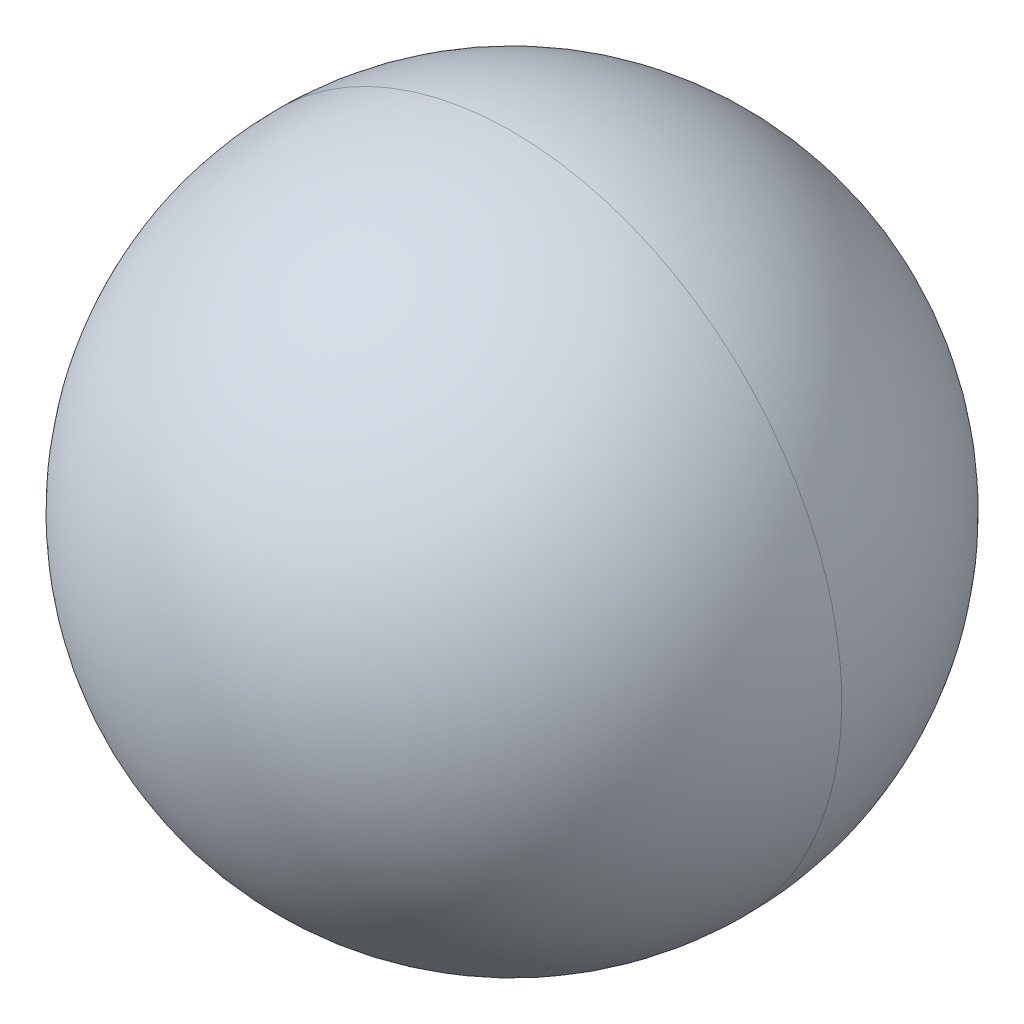
ISO-10303-21;
HEADER;
FILE_DESCRIPTION(('STEP AP214'),'2;1');
FILE_NAME('part.step','',(''),(''),'','','');
FILE_SCHEMA(('AUTOMOTIVE_DESIGN { 1 0 10303 214 1 1 1 1 }'));
ENDSEC;
DATA;
#1=APPLICATION_CONTEXT('core data for automotive mechanical design processes');
#2=APPLICATION_PROTOCOL_DEFINITION('international standard','automotive_design',2000,#1);
#3=PRODUCT_CONTEXT('',#1,'mechanical');
#4=PRODUCT('Part','Part','',(#3));
#5=PRODUCT_RELATED_PRODUCT_CATEGORY('part','',(#4));
#6=PRODUCT_DEFINITION_FORMATION('','',#4);
#7=PRODUCT_DEFINITION_CONTEXT('part definition',#1,'design');
#8=PRODUCT_DEFINITION('design','',#6,#7);
#9=PRODUCT_DEFINITION_SHAPE('','',#8);
#10=(LENGTH_UNIT() NAMED_UNIT(*) SI_UNIT(.MILLI.,.METRE.));
#11=(NAMED_UNIT(*) PLANE_ANGLE_UNIT() SI_UNIT($,.RADIAN.));
#12=(NAMED_UNIT(*) SI_UNIT($,.STERADIAN.) SOLID_ANGLE_UNIT());
#13=UNCERTAINTY_MEASURE_WITH_UNIT(LENGTH_MEASURE(1.E-05),#10,'distance_accuracy_value','');
#14=(GEOMETRIC_REPRESENTATION_CONTEXT(3) GLOBAL_UNCERTAINTY_ASSIGNED_CONTEXT((#13)) GLOBAL_UNIT_ASSIGNED_CONTEXT((#10,
#11,#12)) REPRESENTATION_CONTEXT('',''));
#15=CARTESIAN_POINT('',(0.,0.,0.));
#16=DIRECTION('',(0.,0.,1.));
#17=DIRECTION('',(1.,0.,0.));
#18=AXIS2_PLACEMENT_3D('',#15,#16,#17);
#19=CARTESIAN_POINT('',(0.,0.,0.));
#20=DIRECTION('',(1.,0.,0.));
#21=DIRECTION('',(0.,0.,1.));
#22=AXIS2_PLACEMENT_3D('',#19,#20,#21);
#23=SPHERICAL_SURFACE('',#22,1.35);
#24=CARTESIAN_POINT('',(0.,0.,0.));
#25=DIRECTION('',(0.,0.,1.));
#26=DIRECTION('',(0.,-1.,0.));
#27=AXIS2_PLACEMENT_3D('',#24,#25,#26);
#28=CIRCLE('',#27,1.35);
#29=CARTESIAN_POINT('',(-1.35,0.,0.));
#30=VERTEX_POINT('',#29);
#31=CARTESIAN_POINT('',(1.35,0.,0.));
#32=VERTEX_POINT('',#31);
#33=EDGE_CURVE('E11',#30,#32,#28,.T.);
#34=ORIENTED_EDGE('',*,*,#33,.F.);
#35=CARTESIAN_POINT('',(-1.35,0.,0.));
#36=CARTESIAN_POINT('',(-1.35000046856985,0.0220893456522005,0.));
#37=CARTESIAN_POINT('',(-1.34945786311896,0.0441786514337002,0.));
#38=CARTESIAN_POINT('',(-1.34728986863501,0.0883040692503259,0.));
#39=CARTESIAN_POINT('',(-1.34566447960195,0.110340181285452,0.));
#40=CARTESIAN_POINT('',(-1.34133428241298,0.154306097604359,0.));
#41=CARTESIAN_POINT('',(-1.33862947425706,0.176235901888141,0.));
#42=CARTESIAN_POINT('',(-1.33214710264785,0.219936379141333,0.));
#43=CARTESIAN_POINT('',(-1.32836953919455,0.241707052110744,0.));
#44=CARTESIAN_POINT('',(-1.31975071789417,0.2850368173328,0.));
#45=CARTESIAN_POINT('',(-1.3149094600471,0.306595909585446,0.));
#46=CARTESIAN_POINT('',(-1.30417492357817,0.349450576153364,0.));
#47=CARTESIAN_POINT('',(-1.29828164495631,0.370746150468635,0.));
#48=CARTESIAN_POINT('',(-1.28545726152065,0.41302247811841,0.));
#49=CARTESIAN_POINT('',(-1.27852615670686,0.434003231452914,0.));
#50=CARTESIAN_POINT('',(-1.2636428192873,0.475599372706078,0.));
#51=CARTESIAN_POINT('',(-1.25569058668154,0.496214760624738,0.));
#52=CARTESIAN_POINT('',(-1.23878415109893,0.537030506761002,0.));
#53=CARTESIAN_POINT('',(-1.22982994812208,0.557230864978606,0.));
#54=CARTESIAN_POINT('',(-1.21094114331122,0.597167887283153,0.));
#55=CARTESIAN_POINT('',(-1.2010065414772,0.616904551370097,0.));
#56=CARTESIAN_POINT('',(-1.18018087226336,0.655866638060093,0.));
#57=CARTESIAN_POINT('',(-1.16928980488352,0.675092060663145,0.));
#58=CARTESIAN_POINT('',(-1.14657744211722,0.712985348658551,0.));
#59=CARTESIAN_POINT('',(-1.13475614673075,0.731653214050904,0.));
#60=CARTESIAN_POINT('',(-1.11021180648613,0.768386415102019,0.));
#61=CARTESIAN_POINT('',(-1.09748876162798,0.786451750760781,0.));
#62=CARTESIAN_POINT('',(-1.07117157336976,0.821936371368787,0.));
#63=CARTESIAN_POINT('',(-1.05757742996969,0.839355656318031,0.));
#64=CARTESIAN_POINT('',(-1.0295507941097,0.873506210923809,0.));
#65=CARTESIAN_POINT('',(-1.01511830164979,0.890237480580341,0.));
#66=CARTESIAN_POINT('',(-0.985449736808605,0.922971697506606,0.));
#67=CARTESIAN_POINT('',(-0.97021366442734,0.938974644776338,0.));
#68=CARTESIAN_POINT('',(-0.938974644776342,0.970213664427337,0.));
#69=CARTESIAN_POINT('',(-0.922971697506609,0.985449736808604,0.));
#70=CARTESIAN_POINT('',(-0.890237480580344,1.01511830164978,0.));
#71=CARTESIAN_POINT('',(-0.873506210923811,1.0295507941097,0.));
#72=CARTESIAN_POINT('',(-0.839355656318035,1.05757742996969,0.));
#73=CARTESIAN_POINT('',(-0.821936371368791,1.07117157336978,0.));
#74=CARTESIAN_POINT('',(-0.786451750760783,1.09748876162796,0.));
#75=CARTESIAN_POINT('',(-0.768386415102019,1.11021180648606,0.));
#76=CARTESIAN_POINT('',(-0.731653214050911,1.13475614673081,0.));
#77=CARTESIAN_POINT('',(-0.712985348658566,1.14657744211745,0.));
#78=CARTESIAN_POINT('',(-0.675092060663137,1.16928980488328,0.));
#79=CARTESIAN_POINT('',(-0.655866638060053,1.18018087226246,0.));
#80=CARTESIAN_POINT('',(-0.616904551370145,1.2010065414781,0.));
#81=CARTESIAN_POINT('',(-0.597167887283321,1.21094114331455,0.));
#82=CARTESIAN_POINT('',(-0.557230864978445,1.22982994811874,0.));
#83=CARTESIAN_POINT('',(-0.537030506760394,1.23878415108648,0.));
#84=CARTESIAN_POINT('',(-0.496214760625353,1.25569058669399,0.));
#85=CARTESIAN_POINT('',(-0.475599372708364,1.26364281933377,0.));
#86=CARTESIAN_POINT('',(-0.434003231450635,1.27852615666039,0.));
#87=CARTESIAN_POINT('',(-0.413022478109895,1.28545726134724,0.));
#88=CARTESIAN_POINT('',(-0.370746150477158,1.29828164512973,0.));
#89=CARTESIAN_POINT('',(-0.349450576185162,1.30417492422536,0.));
#90=CARTESIAN_POINT('',(-0.306595909553655,1.3149094593999,0.));
#91=CARTESIAN_POINT('',(-0.285036817214144,1.3197507154788,0.));
#92=CARTESIAN_POINT('',(-0.241707052229407,1.32836954160992,0.));
#93=CARTESIAN_POINT('',(-0.219936379584181,1.33214711166214,0.));
#94=CARTESIAN_POINT('',(-0.176235901445301,1.33862946524277,0.));
#95=CARTESIAN_POINT('',(-0.154306095951648,1.34133424877118,0.));
#96=CARTESIAN_POINT('',(-0.110340182938171,1.34566451324375,0.));
#97=CARTESIAN_POINT('',(-0.0883040754183489,1.34728999418792,0.));
#98=CARTESIAN_POINT('',(-0.0441786452656852,1.34945773756604,0.));
#99=CARTESIAN_POINT('',(-0.0220893226328439,1.35,0.));
#100=CARTESIAN_POINT('',(0.0220893226328385,1.35,0.));
#101=CARTESIAN_POINT('',(0.0441786452656797,1.34945773756604,0.));
#102=CARTESIAN_POINT('',(0.0883040754183435,1.34728999418792,0.));
#103=CARTESIAN_POINT('',(0.110340182938166,1.34566451324375,0.));
#104=CARTESIAN_POINT('',(0.154306095951642,1.34133424877118,0.));
#105=CARTESIAN_POINT('',(0.176235901445296,1.33862946524277,0.));
#106=CARTESIAN_POINT('',(0.219936379584176,1.33214711166214,0.));
#107=CARTESIAN_POINT('',(0.241707052229402,1.32836954160992,0.));
#108=CARTESIAN_POINT('',(0.285036817214139,1.3197507154788,0.));
#109=CARTESIAN_POINT('',(0.30659590955365,1.3149094593999,0.));
#110=CARTESIAN_POINT('',(0.349450576185157,1.30417492422537,0.));
#111=CARTESIAN_POINT('',(0.370746150477153,1.29828164512973,0.));
#112=CARTESIAN_POINT('',(0.41302247810989,1.28545726134724,0.));
#113=CARTESIAN_POINT('',(0.43400323145063,1.27852615666039,0.));
#114=CARTESIAN_POINT('',(0.475599372708359,1.26364281933377,0.));
#115=CARTESIAN_POINT('',(0.496214760625348,1.25569058669399,0.));
#116=CARTESIAN_POINT('',(0.537030506760389,1.23878415108648,0.));
#117=CARTESIAN_POINT('',(0.55723086497844,1.22982994811875,0.));
#118=CARTESIAN_POINT('',(0.597167887283316,1.21094114331455,0.));
#119=CARTESIAN_POINT('',(0.61690455137014,1.2010065414781,0.));
#120=CARTESIAN_POINT('',(0.655866638060048,1.18018087226246,0.));
#121=CARTESIAN_POINT('',(0.675092060663132,1.16928980488328,0.));
#122=CARTESIAN_POINT('',(0.712985348658561,1.14657744211746,0.));
#123=CARTESIAN_POINT('',(0.731653214050906,1.13475614673081,0.));
#124=CARTESIAN_POINT('',(0.768386415102015,1.11021180648607,0.));
#125=CARTESIAN_POINT('',(0.786451750760779,1.09748876162796,0.));
#126=CARTESIAN_POINT('',(0.821936371368787,1.07117157336978,0.));
#127=CARTESIAN_POINT('',(0.839355656318031,1.0575774299697,0.));
#128=CARTESIAN_POINT('',(0.873506210923807,1.0295507941097,0.));
#129=CARTESIAN_POINT('',(0.89023748058034,1.01511830164979,0.));
#130=CARTESIAN_POINT('',(0.922971697506605,0.985449736808608,0.));
#131=CARTESIAN_POINT('',(0.938974644776338,0.970213664427341,0.));
#132=CARTESIAN_POINT('',(0.970213664427336,0.938974644776342,0.));
#133=CARTESIAN_POINT('',(0.985449736808602,0.92297169750661,0.));
#134=CARTESIAN_POINT('',(1.01511830164978,0.890237480580345,0.));
#135=CARTESIAN_POINT('',(1.0295507941097,0.873506210923813,0.));
#136=CARTESIAN_POINT('',(1.05757742996969,0.839355656318035,0.));
#137=CARTESIAN_POINT('',(1.07117157336976,0.821936371368791,0.));
#138=CARTESIAN_POINT('',(1.09748876162798,0.786451750760785,0.));
#139=CARTESIAN_POINT('',(1.11021180648613,0.768386415102023,0.));
#140=CARTESIAN_POINT('',(1.13475614673074,0.731653214050908,0.));
#141=CARTESIAN_POINT('',(1.14657744211721,0.712985348658555,0.));
#142=CARTESIAN_POINT('',(1.16928980488352,0.67509206066315,0.));
#143=CARTESIAN_POINT('',(1.18018087226335,0.655866638060098,0.));
#144=CARTESIAN_POINT('',(1.2010065414772,0.616904551370102,0.));
#145=CARTESIAN_POINT('',(1.21094114331121,0.597167887283158,0.));
#146=CARTESIAN_POINT('',(1.22982994812208,0.55723086497861,0.));
#147=CARTESIAN_POINT('',(1.23878415109893,0.537030506761007,0.));
#148=CARTESIAN_POINT('',(1.25569058668154,0.496214760624743,0.));
#149=CARTESIAN_POINT('',(1.2636428192873,0.475599372706082,0.));
#150=CARTESIAN_POINT('',(1.27852615670686,0.434003231452918,0.));
#151=CARTESIAN_POINT('',(1.28545726152065,0.413022478118415,0.));
#152=CARTESIAN_POINT('',(1.29828164495631,0.37074615046864,0.));
#153=CARTESIAN_POINT('',(1.30417492357817,0.349450576153368,0.));
#154=CARTESIAN_POINT('',(1.3149094600471,0.306595909585451,0.));
#155=CARTESIAN_POINT('',(1.31975071789417,0.285036817332805,0.));
#156=CARTESIAN_POINT('',(1.32836953919455,0.241707052110749,0.));
#157=CARTESIAN_POINT('',(1.33214710264785,0.219936379141338,0.));
#158=CARTESIAN_POINT('',(1.33862947425706,0.176235901888146,0.));
#159=CARTESIAN_POINT('',(1.34133428241298,0.154306097604365,0.));
#160=CARTESIAN_POINT('',(1.34566447960195,0.110340181285458,0.));
#161=CARTESIAN_POINT('',(1.34728986863501,0.0883040692503318,0.));
#162=CARTESIAN_POINT('',(1.34945786311896,0.044178651433706,0.));
#163=CARTESIAN_POINT('',(1.35000046856985,0.0220893456522061,0.));
#164=CARTESIAN_POINT('',(1.35,0.,0.));
#165=B_SPLINE_CURVE_WITH_KNOTS('',3,(#35,#36,#37,#38,#39,#40,#41,#42,#43,#44,#45,#46,#47,#48,
#49,#50,#51,#52,#53,#54,#55,#56,#57,#58,#59,#60,#61,#62,#63,#64,#65,#66,#67,#68,#69,#70,#71,#72,
#73,#74,#75,#76,#77,#78,#79,#80,#81,#82,#83,#84,#85,#86,#87,#88,#89,#90,#91,#92,#93,#94,#95,#96,
#97,#98,#99,#100,#101,#102,#103,#104,#105,#106,#107,#108,#109,#110,#111,#112,#113,#114,#115,
#116,#117,#118,#119,#120,#121,#122,#123,#124,#125,#126,#127,#128,#129,#130,#131,#132,#133,#134,
#135,#136,#137,#138,#139,#140,#141,#142,#143,#144,#145,#146,#147,#148,#149,#150,#151,#152,#153,
#154,#155,#156,#157,#158,#159,#160,#161,#162,#163,#164),.UNSPECIFIED.,.F.,.F.,(4,2,2,2,2,2,2,2,
2,2,2,2,2,2,2,2,2,2,2,2,2,2,2,2,2,2,2,2,2,2,2,2,2,2,2,2,2,2,2,2,2,2,2,2,2,2,2,2,2,2,2,2,2,2,2,2,
2,2,2,2,2,2,2,2,4),(0.,0.066261317011863,0.132522634023726,0.198783951035589,0.265045268047453,
0.331306585059316,0.397567902071179,0.463829219083042,0.530090536094905,0.596351853106768,
0.662613170118631,0.728874487130495,0.795135804142358,0.861397121154221,0.927658438166084,
0.993919755177947,1.06018107218981,1.12644238920167,1.19270370621354,1.2589650232254,
1.32522634023726,1.39148765724913,1.45774897426099,1.52401029127285,1.59027160828472,
1.65653292529658,1.72279424230844,1.7890555593203,1.85531687633217,1.92157819334403,
1.98783951035589,2.05410082736776,2.12036214437962,2.18662346139148,2.25288477840335,
2.31914609541521,2.38540741242707,2.45166872943894,2.5179300464508,2.58419136346266,
2.65045268047453,2.71671399748639,2.78297531449825,2.84923663151011,2.91549794852198,
2.98175926553384,3.0480205825457,3.11428189955757,3.18054321656943,3.24680453358129,
3.31306585059316,3.37932716760502,3.44558848461688,3.51184980162875,3.57811111864061,
3.64437243565247,3.71063375266434,3.7768950696762,3.84315638668806,3.90941770369992,
3.97567902071179,4.04194033772365,4.10820165473551,4.17446297174738,4.24072428875924),.UNSPECIFIED.);
#166=EDGE_CURVE('E26',#30,#32,#165,.T.);
#167=ORIENTED_EDGE('',*,*,#166,.T.);
#168=EDGE_LOOP('',(#34,#167));
#169=FACE_BOUND('',#168,.T.);
#170=ADVANCED_FACE('F17',(#169),#23,.T.);
#171=CARTESIAN_POINT('',(0.,0.,0.));
#172=DIRECTION('',(1.,0.,0.));
#173=DIRECTION('',(0.,0.,-1.));
#174=AXIS2_PLACEMENT_3D('',#171,#172,#173);
#175=SPHERICAL_SURFACE('',#174,1.35);
#176=ORIENTED_EDGE('',*,*,#33,.T.);
#177=ORIENTED_EDGE('',*,*,#166,.F.);
#178=EDGE_LOOP('',(#176,#177));
#179=FACE_BOUND('',#178,.T.);
#180=ADVANCED_FACE('F36',(#179),#175,.T.);
#181=CLOSED_SHELL('',(#170,#180));
#182=MANIFOLD_SOLID_BREP('B1',#181);
#183=ADVANCED_BREP_SHAPE_REPRESENTATION('',(#18,#182),#14);
#184=SHAPE_DEFINITION_REPRESENTATION(#9,#183);
ENDSEC;
END-ISO-10303-21;
